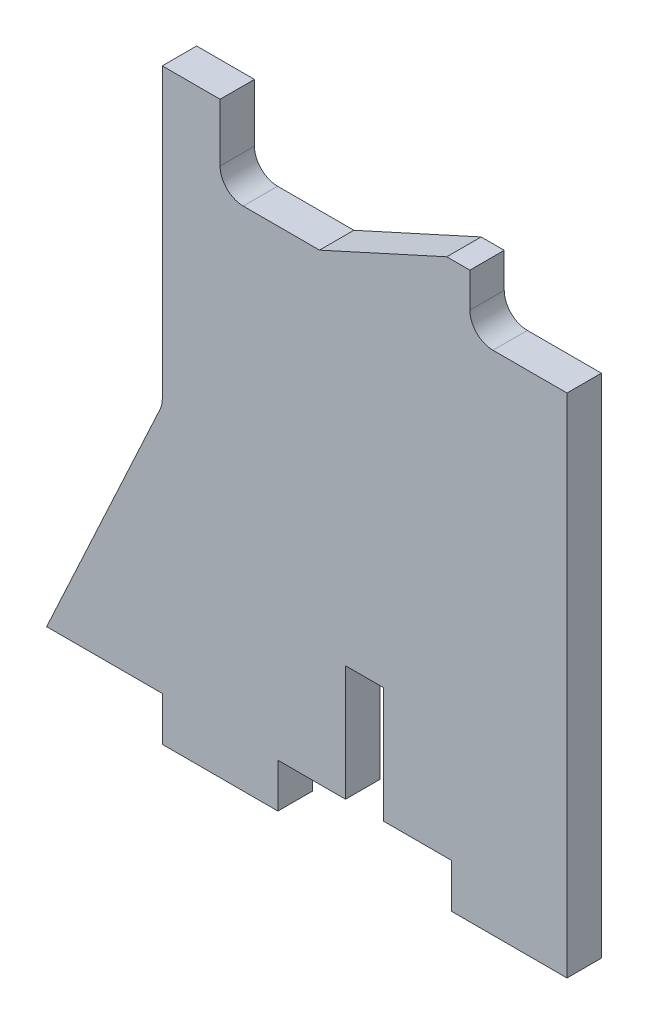
ISO-10303-21;
HEADER;
FILE_DESCRIPTION(('STEP AP214'),'2;1');
FILE_NAME('part.step','',(''),(''),'','','');
FILE_SCHEMA(('AUTOMOTIVE_DESIGN { 1 0 10303 214 1 1 1 1 }'));
ENDSEC;
DATA;
#1=APPLICATION_CONTEXT('core data for automotive mechanical design processes');
#2=APPLICATION_PROTOCOL_DEFINITION('international standard','automotive_design',2000,#1);
#3=PRODUCT_CONTEXT('',#1,'mechanical');
#4=PRODUCT('Part','Part','',(#3));
#5=PRODUCT_RELATED_PRODUCT_CATEGORY('part','',(#4));
#6=PRODUCT_DEFINITION_FORMATION('','',#4);
#7=PRODUCT_DEFINITION_CONTEXT('part definition',#1,'design');
#8=PRODUCT_DEFINITION('design','',#6,#7);
#9=PRODUCT_DEFINITION_SHAPE('','',#8);
#10=(LENGTH_UNIT() NAMED_UNIT(*) SI_UNIT(.MILLI.,.METRE.));
#11=(NAMED_UNIT(*) PLANE_ANGLE_UNIT() SI_UNIT($,.RADIAN.));
#12=(NAMED_UNIT(*) SI_UNIT($,.STERADIAN.) SOLID_ANGLE_UNIT());
#13=UNCERTAINTY_MEASURE_WITH_UNIT(LENGTH_MEASURE(1.E-05),#10,'distance_accuracy_value','');
#14=(GEOMETRIC_REPRESENTATION_CONTEXT(3) GLOBAL_UNCERTAINTY_ASSIGNED_CONTEXT((#13)) GLOBAL_UNIT_ASSIGNED_CONTEXT((#10,
#11,#12)) REPRESENTATION_CONTEXT('',''));
#15=CARTESIAN_POINT('',(0.,0.,0.));
#16=DIRECTION('',(0.,0.,1.));
#17=DIRECTION('',(1.,0.,0.));
#18=AXIS2_PLACEMENT_3D('',#15,#16,#17);
#19=CARTESIAN_POINT('',(-17.5,-20.,2.9718));
#20=DIRECTION('',(0.,1.,0.));
#21=DIRECTION('',(0.,0.,1.));
#22=AXIS2_PLACEMENT_3D('',#19,#20,#21);
#23=PLANE('',#22);
#24=DIRECTION('',(1.,0.,0.));
#25=VECTOR('',#24,1.);
#26=CARTESIAN_POINT('',(-17.5,-20.,0.));
#27=LINE('',#26,#25);
#28=CARTESIAN_POINT('',(-7.50000000000001,-20.,0.));
#29=VERTEX_POINT('',#28);
#30=CARTESIAN_POINT('',(-1.651,-20.,0.));
#31=VERTEX_POINT('',#30);
#32=EDGE_CURVE('E207',#29,#31,#27,.T.);
#33=ORIENTED_EDGE('',*,*,#32,.T.);
#34=DIRECTION('',(0.,0.,1.));
#35=VECTOR('',#34,1.);
#36=CARTESIAN_POINT('',(-1.651,-20.,0.));
#37=LINE('',#36,#35);
#38=CARTESIAN_POINT('',(-1.651,-20.,2.9718));
#39=VERTEX_POINT('',#38);
#40=EDGE_CURVE('E192',#31,#39,#37,.T.);
#41=ORIENTED_EDGE('',*,*,#40,.T.);
#42=DIRECTION('',(1.,0.,0.));
#43=VECTOR('',#42,1.);
#44=CARTESIAN_POINT('',(-17.5,-20.,2.9718));
#45=LINE('',#44,#43);
#46=CARTESIAN_POINT('',(-7.50000000000001,-20.,2.9718));
#47=VERTEX_POINT('',#46);
#48=EDGE_CURVE('E229',#47,#39,#45,.T.);
#49=ORIENTED_EDGE('',*,*,#48,.F.);
#50=DIRECTION('',(0.,0.,1.));
#51=VECTOR('',#50,1.);
#52=CARTESIAN_POINT('',(-7.50000000000001,-20.,0.));
#53=LINE('',#52,#51);
#54=EDGE_CURVE('E214',#29,#47,#53,.T.);
#55=ORIENTED_EDGE('',*,*,#54,.F.);
#56=EDGE_LOOP('',(#33,#41,#49,#55));
#57=FACE_BOUND('',#56,.T.);
#58=ADVANCED_FACE('F32',(#57),#23,.F.);
#59=CARTESIAN_POINT('',(-19.5,2.03559672661456,2.9718));
#60=DIRECTION('',(0.,0.,1.));
#61=DIRECTION('',(1.,0.,0.));
#62=AXIS2_PLACEMENT_3D('',#59,#60,#61);
#63=CYLINDRICAL_SURFACE('',#62,2.);
#64=DIRECTION('',(0.,0.,1.));
#65=VECTOR('',#64,1.);
#66=CARTESIAN_POINT('',(-17.5,2.03559672661456,2.9718));
#67=LINE('',#66,#65);
#68=CARTESIAN_POINT('',(-17.5,2.03559672661455,0.));
#69=VERTEX_POINT('',#68);
#70=CARTESIAN_POINT('',(-17.5,2.03559672661455,2.9718));
#71=VERTEX_POINT('',#70);
#72=EDGE_CURVE('E249',#69,#71,#67,.T.);
#73=ORIENTED_EDGE('',*,*,#72,.F.);
#74=CARTESIAN_POINT('',(-19.5,2.03559672661456,0.));
#75=DIRECTION('',(0.,0.,-1.));
#76=DIRECTION('',(-1.,0.,0.));
#77=AXIS2_PLACEMENT_3D('',#74,#75,#76);
#78=CIRCLE('',#77,2.);
#79=CARTESIAN_POINT('',(-17.68514036038,1.19518939175929,0.));
#80=VERTEX_POINT('',#79);
#81=EDGE_CURVE('E40',#69,#80,#78,.T.);
#82=ORIENTED_EDGE('',*,*,#81,.T.);
#83=DIRECTION('',(0.,0.,1.));
#84=VECTOR('',#83,1.);
#85=CARTESIAN_POINT('',(-17.68514036038,1.19518939175929,0.));
#86=LINE('',#85,#84);
#87=CARTESIAN_POINT('',(-17.68514036038,1.19518939175929,2.9718));
#88=VERTEX_POINT('',#87);
#89=EDGE_CURVE('E252',#88,#80,#86,.F.);
#90=ORIENTED_EDGE('',*,*,#89,.F.);
#91=CARTESIAN_POINT('',(-19.5,2.03559672661456,2.9718));
#92=DIRECTION('',(0.,0.,-1.));
#93=DIRECTION('',(-1.,0.,0.));
#94=AXIS2_PLACEMENT_3D('',#91,#92,#93);
#95=CIRCLE('',#94,2.);
#96=EDGE_CURVE('E11',#88,#71,#95,.F.);
#97=ORIENTED_EDGE('',*,*,#96,.T.);
#98=EDGE_LOOP('',(#73,#82,#90,#97));
#99=FACE_BOUND('',#98,.T.);
#100=ADVANCED_FACE('F34',(#99),#63,.F.);
#101=CARTESIAN_POINT('',(11.0995698808157,22.,0.));
#102=DIRECTION('',(0.,0.,-1.));
#103=DIRECTION('',(-1.,0.,0.));
#104=AXIS2_PLACEMENT_3D('',#101,#102,#103);
#105=CYLINDRICAL_SURFACE('',#104,2.);
#106=DIRECTION('',(0.,0.,-1.));
#107=VECTOR('',#106,1.);
#108=CARTESIAN_POINT('',(9.09956988081569,22.,0.));
#109=LINE('',#108,#107);
#110=CARTESIAN_POINT('',(9.09956988081569,22.,2.9718));
#111=VERTEX_POINT('',#110);
#112=CARTESIAN_POINT('',(9.09956988081569,22.,0.));
#113=VERTEX_POINT('',#112);
#114=EDGE_CURVE('E239',#111,#113,#109,.T.);
#115=ORIENTED_EDGE('',*,*,#114,.F.);
#116=CARTESIAN_POINT('',(11.0995698808157,22.,2.9718));
#117=DIRECTION('',(0.,0.,-1.));
#118=DIRECTION('',(-1.,0.,0.));
#119=AXIS2_PLACEMENT_3D('',#116,#117,#118);
#120=CIRCLE('',#119,2.);
#121=CARTESIAN_POINT('',(11.0995698808157,20.,2.9718));
#122=VERTEX_POINT('',#121);
#123=EDGE_CURVE('E245',#111,#122,#120,.F.);
#124=ORIENTED_EDGE('',*,*,#123,.T.);
#125=DIRECTION('',(0.,0.,-1.));
#126=VECTOR('',#125,1.);
#127=CARTESIAN_POINT('',(11.0995698808157,20.,2.9718));
#128=LINE('',#127,#126);
#129=CARTESIAN_POINT('',(11.0995698808157,20.,0.));
#130=VERTEX_POINT('',#129);
#131=EDGE_CURVE('E242',#130,#122,#128,.F.);
#132=ORIENTED_EDGE('',*,*,#131,.F.);
#133=CARTESIAN_POINT('',(11.0995698808157,22.,0.));
#134=DIRECTION('',(0.,0.,-1.));
#135=DIRECTION('',(-1.,0.,0.));
#136=AXIS2_PLACEMENT_3D('',#133,#134,#135);
#137=CIRCLE('',#136,2.);
#138=EDGE_CURVE('E247',#130,#113,#137,.T.);
#139=ORIENTED_EDGE('',*,*,#138,.T.);
#140=EDGE_LOOP('',(#115,#124,#132,#139));
#141=FACE_BOUND('',#140,.T.);
#142=ADVANCED_FACE('F400',(#141),#105,.F.);
#143=CARTESIAN_POINT('',(-10.5,22.,0.));
#144=DIRECTION('',(0.,0.,-1.));
#145=DIRECTION('',(-1.,0.,0.));
#146=AXIS2_PLACEMENT_3D('',#143,#144,#145);
#147=CYLINDRICAL_SURFACE('',#146,2.);
#148=DIRECTION('',(0.,0.,-1.));
#149=VECTOR('',#148,1.);
#150=CARTESIAN_POINT('',(-12.5,22.,0.));
#151=LINE('',#150,#149);
#152=CARTESIAN_POINT('',(-12.5,22.,2.9718));
#153=VERTEX_POINT('',#152);
#154=CARTESIAN_POINT('',(-12.5,22.,0.));
#155=VERTEX_POINT('',#154);
#156=EDGE_CURVE('E228',#153,#155,#151,.T.);
#157=ORIENTED_EDGE('',*,*,#156,.F.);
#158=CARTESIAN_POINT('',(-10.5,22.,2.9718));
#159=DIRECTION('',(0.,0.,-1.));
#160=DIRECTION('',(-1.,0.,0.));
#161=AXIS2_PLACEMENT_3D('',#158,#159,#160);
#162=CIRCLE('',#161,2.);
#163=CARTESIAN_POINT('',(-10.5,20.,2.9718));
#164=VERTEX_POINT('',#163);
#165=EDGE_CURVE('E235',#153,#164,#162,.F.);
#166=ORIENTED_EDGE('',*,*,#165,.T.);
#167=DIRECTION('',(0.,0.,-1.));
#168=VECTOR('',#167,1.);
#169=CARTESIAN_POINT('',(-10.5,20.,2.9718));
#170=LINE('',#169,#168);
#171=CARTESIAN_POINT('',(-10.5,20.,0.));
#172=VERTEX_POINT('',#171);
#173=EDGE_CURVE('E232',#172,#164,#170,.F.);
#174=ORIENTED_EDGE('',*,*,#173,.F.);
#175=CARTESIAN_POINT('',(-10.5,22.,0.));
#176=DIRECTION('',(0.,0.,-1.));
#177=DIRECTION('',(-1.,0.,0.));
#178=AXIS2_PLACEMENT_3D('',#175,#176,#177);
#179=CIRCLE('',#178,2.);
#180=EDGE_CURVE('E237',#172,#155,#179,.T.);
#181=ORIENTED_EDGE('',*,*,#180,.T.);
#182=EDGE_LOOP('',(#157,#166,#174,#181));
#183=FACE_BOUND('',#182,.T.);
#184=ADVANCED_FACE('F382',(#183),#147,.F.);
#185=CARTESIAN_POINT('',(-17.5,-20.,2.9718));
#186=DIRECTION('',(1.,0.,0.));
#187=DIRECTION('',(0.,0.,-1.));
#188=AXIS2_PLACEMENT_3D('',#185,#186,#187);
#189=PLANE('',#188);
#190=DIRECTION('',(0.,0.,1.));
#191=VECTOR('',#190,1.);
#192=CARTESIAN_POINT('',(-17.5,-20.,0.));
#193=LINE('',#192,#191);
#194=CARTESIAN_POINT('',(-17.5,-20.,0.));
#195=VERTEX_POINT('',#194);
#196=CARTESIAN_POINT('',(-17.5,-20.,2.9718));
#197=VERTEX_POINT('',#196);
#198=EDGE_CURVE('E274',#195,#197,#193,.T.);
#199=ORIENTED_EDGE('',*,*,#198,.F.);
#200=DIRECTION('',(0.,-1.,0.));
#201=VECTOR('',#200,1.);
#202=CARTESIAN_POINT('',(-17.5,-20.,0.));
#203=LINE('',#202,#201);
#204=CARTESIAN_POINT('',(-17.5,-23.81,0.));
#205=VERTEX_POINT('',#204);
#206=EDGE_CURVE('E368',#195,#205,#203,.T.);
#207=ORIENTED_EDGE('',*,*,#206,.T.);
#208=DIRECTION('',(0.,0.,1.));
#209=VECTOR('',#208,1.);
#210=CARTESIAN_POINT('',(-17.5,-23.81,0.));
#211=LINE('',#210,#209);
#212=CARTESIAN_POINT('',(-17.5,-23.81,2.9718));
#213=VERTEX_POINT('',#212);
#214=EDGE_CURVE('E304',#205,#213,#211,.T.);
#215=ORIENTED_EDGE('',*,*,#214,.T.);
#216=DIRECTION('',(0.,-1.,0.));
#217=VECTOR('',#216,1.);
#218=CARTESIAN_POINT('',(-17.5,-20.,2.9718));
#219=LINE('',#218,#217);
#220=EDGE_CURVE('E358',#197,#213,#219,.T.);
#221=ORIENTED_EDGE('',*,*,#220,.F.);
#222=EDGE_LOOP('',(#199,#207,#215,#221));
#223=FACE_BOUND('',#222,.T.);
#224=ADVANCED_FACE('F452',(#223),#189,.F.);
#225=CARTESIAN_POINT('',(1.65100000000001,-20.,2.9718));
#226=VERTEX_POINT('',#225);
#227=CARTESIAN_POINT('',(7.5,-20.,2.9718));
#228=VERTEX_POINT('',#227);
#229=EDGE_CURVE('E362',#226,#228,#45,.T.);
#230=ORIENTED_EDGE('',*,*,#229,.F.);
#231=DIRECTION('',(0.,0.,1.));
#232=VECTOR('',#231,1.);
#233=CARTESIAN_POINT('',(1.65100000000001,-20.,0.));
#234=LINE('',#233,#232);
#235=CARTESIAN_POINT('',(1.65100000000001,-20.,0.));
#236=VERTEX_POINT('',#235);
#237=EDGE_CURVE('E201',#236,#226,#234,.T.);
#238=ORIENTED_EDGE('',*,*,#237,.F.);
#239=CARTESIAN_POINT('',(7.5,-20.,0.));
#240=VERTEX_POINT('',#239);
#241=EDGE_CURVE('E216',#236,#240,#27,.T.);
#242=ORIENTED_EDGE('',*,*,#241,.T.);
#243=DIRECTION('',(0.,0.,1.));
#244=VECTOR('',#243,1.);
#245=CARTESIAN_POINT('',(7.5,-20.,0.));
#246=LINE('',#245,#244);
#247=EDGE_CURVE('E285',#240,#228,#246,.T.);
#248=ORIENTED_EDGE('',*,*,#247,.T.);
#249=EDGE_LOOP('',(#230,#238,#242,#248));
#250=FACE_BOUND('',#249,.T.);
#251=ADVANCED_FACE('F418',(#250),#23,.F.);
#252=CARTESIAN_POINT('',(-17.5,20.,2.9718));
#253=DIRECTION('',(0.,-1.,0.));
#254=DIRECTION('',(0.,0.,-1.));
#255=AXIS2_PLACEMENT_3D('',#252,#253,#254);
#256=PLANE('',#255);
#257=DIRECTION('',(-1.,0.,0.));
#258=VECTOR('',#257,1.);
#259=CARTESIAN_POINT('',(-17.5,20.,0.));
#260=LINE('',#259,#258);
#261=CARTESIAN_POINT('',(-3.90043011918431,20.,0.));
#262=VERTEX_POINT('',#261);
#263=EDGE_CURVE('E365',#262,#172,#260,.T.);
#264=ORIENTED_EDGE('',*,*,#263,.T.);
#265=ORIENTED_EDGE('',*,*,#173,.T.);
#266=DIRECTION('',(-1.,0.,0.));
#267=VECTOR('',#266,1.);
#268=CARTESIAN_POINT('',(-17.5,20.,2.9718));
#269=LINE('',#268,#267);
#270=CARTESIAN_POINT('',(-3.90043011918433,20.,2.9718));
#271=VERTEX_POINT('',#270);
#272=EDGE_CURVE('E219',#271,#164,#269,.T.);
#273=ORIENTED_EDGE('',*,*,#272,.F.);
#274=DIRECTION('',(0.,0.,1.));
#275=VECTOR('',#274,1.);
#276=CARTESIAN_POINT('',(-3.90043011918431,20.,0.));
#277=LINE('',#276,#275);
#278=EDGE_CURVE('E331',#262,#271,#277,.T.);
#279=ORIENTED_EDGE('',*,*,#278,.F.);
#280=EDGE_LOOP('',(#264,#265,#273,#279));
#281=FACE_BOUND('',#280,.T.);
#282=ADVANCED_FACE('F373',(#281),#256,.F.);
#283=CARTESIAN_POINT('',(17.5,-20.,2.9718));
#284=DIRECTION('',(-1.,0.,0.));
#285=DIRECTION('',(0.,0.,1.));
#286=AXIS2_PLACEMENT_3D('',#283,#284,#285);
#287=PLANE('',#286);
#288=DIRECTION('',(0.,1.,0.));
#289=VECTOR('',#288,1.);
#290=CARTESIAN_POINT('',(17.5,-20.,0.));
#291=LINE('',#290,#289);
#292=CARTESIAN_POINT('',(17.5,-23.81,0.));
#293=VERTEX_POINT('',#292);
#294=CARTESIAN_POINT('',(17.5,20.,0.));
#295=VERTEX_POINT('',#294);
#296=EDGE_CURVE('E352',#293,#295,#291,.T.);
#297=ORIENTED_EDGE('',*,*,#296,.T.);
#298=DIRECTION('',(0.,0.,-1.));
#299=VECTOR('',#298,1.);
#300=CARTESIAN_POINT('',(17.5,20.,2.9718));
#301=LINE('',#300,#299);
#302=CARTESIAN_POINT('',(17.5,20.,2.9718));
#303=VERTEX_POINT('',#302);
#304=EDGE_CURVE('E225',#303,#295,#301,.T.);
#305=ORIENTED_EDGE('',*,*,#304,.F.);
#306=DIRECTION('',(0.,1.,0.));
#307=VECTOR('',#306,1.);
#308=CARTESIAN_POINT('',(17.5,-20.,2.9718));
#309=LINE('',#308,#307);
#310=CARTESIAN_POINT('',(17.5,-23.81,2.9718));
#311=VERTEX_POINT('',#310);
#312=EDGE_CURVE('E215',#311,#303,#309,.T.);
#313=ORIENTED_EDGE('',*,*,#312,.F.);
#314=DIRECTION('',(0.,0.,1.));
#315=VECTOR('',#314,1.);
#316=CARTESIAN_POINT('',(17.5,-23.81,0.));
#317=LINE('',#316,#315);
#318=EDGE_CURVE('E290',#293,#311,#317,.T.);
#319=ORIENTED_EDGE('',*,*,#318,.F.);
#320=EDGE_LOOP('',(#297,#305,#313,#319));
#321=FACE_BOUND('',#320,.T.);
#322=ADVANCED_FACE('F406',(#321),#287,.F.);
#323=EDGE_CURVE('E366',#295,#130,#260,.T.);
#324=ORIENTED_EDGE('',*,*,#323,.T.);
#325=ORIENTED_EDGE('',*,*,#131,.T.);
#326=EDGE_CURVE('E355',#303,#122,#269,.T.);
#327=ORIENTED_EDGE('',*,*,#326,.F.);
#328=ORIENTED_EDGE('',*,*,#304,.T.);
#329=EDGE_LOOP('',(#324,#325,#327,#328));
#330=FACE_BOUND('',#329,.T.);
#331=ADVANCED_FACE('F401',(#330),#256,.F.);
#332=CARTESIAN_POINT('',(-17.5,27.,0.));
#333=VERTEX_POINT('',#332);
#334=EDGE_CURVE('E221',#333,#69,#203,.T.);
#335=ORIENTED_EDGE('',*,*,#334,.T.);
#336=ORIENTED_EDGE('',*,*,#72,.T.);
#337=CARTESIAN_POINT('',(-17.5,27.,2.9718));
#338=VERTEX_POINT('',#337);
#339=EDGE_CURVE('E359',#338,#71,#219,.T.);
#340=ORIENTED_EDGE('',*,*,#339,.F.);
#341=DIRECTION('',(0.,0.,1.));
#342=VECTOR('',#341,1.);
#343=CARTESIAN_POINT('',(-17.5,27.,0.));
#344=LINE('',#343,#342);
#345=EDGE_CURVE('E349',#333,#338,#344,.T.);
#346=ORIENTED_EDGE('',*,*,#345,.F.);
#347=EDGE_LOOP('',(#335,#336,#340,#346));
#348=FACE_BOUND('',#347,.T.);
#349=ADVANCED_FACE('F459',(#348),#189,.F.);
#350=CARTESIAN_POINT('',(0.,0.,2.9718));
#351=DIRECTION('',(0.,0.,-1.));
#352=DIRECTION('',(-1.,0.,0.));
#353=AXIS2_PLACEMENT_3D('',#350,#351,#352);
#354=PLANE('',#353);
#355=ORIENTED_EDGE('',*,*,#48,.T.);
#356=DIRECTION('',(0.,-1.,0.));
#357=VECTOR('',#356,1.);
#358=CARTESIAN_POINT('',(-1.651,-20.,2.9718));
#359=LINE('',#358,#357);
#360=CARTESIAN_POINT('',(-1.651,-10.,2.9718));
#361=VERTEX_POINT('',#360);
#362=EDGE_CURVE('E197',#361,#39,#359,.T.);
#363=ORIENTED_EDGE('',*,*,#362,.F.);
#364=DIRECTION('',(-1.,0.,0.));
#365=VECTOR('',#364,1.);
#366=CARTESIAN_POINT('',(-1.651,-10.,2.9718));
#367=LINE('',#366,#365);
#368=CARTESIAN_POINT('',(1.651,-10.,2.9718));
#369=VERTEX_POINT('',#368);
#370=EDGE_CURVE('E211',#369,#361,#367,.T.);
#371=ORIENTED_EDGE('',*,*,#370,.F.);
#372=DIRECTION('',(0.,1.,0.));
#373=VECTOR('',#372,1.);
#374=CARTESIAN_POINT('',(1.65100000000001,-20.,2.9718));
#375=LINE('',#374,#373);
#376=EDGE_CURVE('E425',#226,#369,#375,.T.);
#377=ORIENTED_EDGE('',*,*,#376,.F.);
#378=ORIENTED_EDGE('',*,*,#229,.T.);
#379=DIRECTION('',(0.,-1.,0.));
#380=VECTOR('',#379,1.);
#381=CARTESIAN_POINT('',(7.5,-20.,2.9718));
#382=LINE('',#381,#380);
#383=CARTESIAN_POINT('',(7.5,-23.81,2.9718));
#384=VERTEX_POINT('',#383);
#385=EDGE_CURVE('E276',#228,#384,#382,.T.);
#386=ORIENTED_EDGE('',*,*,#385,.T.);
#387=DIRECTION('',(1.,0.,0.));
#388=VECTOR('',#387,1.);
#389=CARTESIAN_POINT('',(17.5,-23.81,2.9718));
#390=LINE('',#389,#388);
#391=EDGE_CURVE('E282',#384,#311,#390,.T.);
#392=ORIENTED_EDGE('',*,*,#391,.T.);
#393=ORIENTED_EDGE('',*,*,#312,.T.);
#394=ORIENTED_EDGE('',*,*,#326,.T.);
#395=ORIENTED_EDGE('',*,*,#123,.F.);
#396=DIRECTION('',(0.,1.,0.));
#397=VECTOR('',#396,1.);
#398=CARTESIAN_POINT('',(9.09956988081569,25.,2.9718));
#399=LINE('',#398,#397);
#400=CARTESIAN_POINT('',(9.09956988081569,25.,2.9718));
#401=VERTEX_POINT('',#400);
#402=EDGE_CURVE('E310',#111,#401,#399,.T.);
#403=ORIENTED_EDGE('',*,*,#402,.T.);
#404=DIRECTION('',(-1.,0.,0.));
#405=VECTOR('',#404,1.);
#406=CARTESIAN_POINT('',(7.09956988081569,25.,2.9718));
#407=LINE('',#406,#405);
#408=CARTESIAN_POINT('',(7.09956988081569,25.,2.9718));
#409=VERTEX_POINT('',#408);
#410=EDGE_CURVE('E326',#401,#409,#407,.T.);
#411=ORIENTED_EDGE('',*,*,#410,.T.);
#412=DIRECTION('',(-0.910366477462605,-0.413802944301184,0.));
#413=VECTOR('',#412,1.);
#414=CARTESIAN_POINT('',(-3.90043011918431,20.,2.9718));
#415=LINE('',#414,#413);
#416=EDGE_CURVE('E318',#409,#271,#415,.T.);
#417=ORIENTED_EDGE('',*,*,#416,.T.);
#418=ORIENTED_EDGE('',*,*,#272,.T.);
#419=ORIENTED_EDGE('',*,*,#165,.F.);
#420=DIRECTION('',(0.,1.,0.));
#421=VECTOR('',#420,1.);
#422=CARTESIAN_POINT('',(-12.5,20.,2.9718));
#423=LINE('',#422,#421);
#424=CARTESIAN_POINT('',(-12.5,27.,2.9718));
#425=VERTEX_POINT('',#424);
#426=EDGE_CURVE('E334',#153,#425,#423,.T.);
#427=ORIENTED_EDGE('',*,*,#426,.T.);
#428=DIRECTION('',(-1.,0.,0.));
#429=VECTOR('',#428,1.);
#430=CARTESIAN_POINT('',(-17.5,27.,2.9718));
#431=LINE('',#430,#429);
#432=EDGE_CURVE('E342',#425,#338,#431,.T.);
#433=ORIENTED_EDGE('',*,*,#432,.T.);
#434=ORIENTED_EDGE('',*,*,#339,.T.);
#435=ORIENTED_EDGE('',*,*,#96,.F.);
#436=DIRECTION('',(-0.420203667427634,-0.907429819809977,0.));
#437=VECTOR('',#436,1.);
#438=CARTESIAN_POINT('',(-27.5,-20.,2.9718));
#439=LINE('',#438,#437);
#440=CARTESIAN_POINT('',(-27.5,-20.,2.9718));
#441=VERTEX_POINT('',#440);
#442=EDGE_CURVE('E260',#88,#441,#439,.T.);
#443=ORIENTED_EDGE('',*,*,#442,.T.);
#444=DIRECTION('',(1.,0.,0.));
#445=VECTOR('',#444,1.);
#446=CARTESIAN_POINT('',(-17.5,-20.,2.9718));
#447=LINE('',#446,#445);
#448=EDGE_CURVE('E264',#441,#197,#447,.T.);
#449=ORIENTED_EDGE('',*,*,#448,.T.);
#450=ORIENTED_EDGE('',*,*,#220,.T.);
#451=DIRECTION('',(1.,0.,0.));
#452=VECTOR('',#451,1.);
#453=CARTESIAN_POINT('',(-17.5,-23.81,2.9718));
#454=LINE('',#453,#452);
#455=CARTESIAN_POINT('',(-7.50000000000001,-23.81,2.9718));
#456=VERTEX_POINT('',#455);
#457=EDGE_CURVE('E293',#213,#456,#454,.T.);
#458=ORIENTED_EDGE('',*,*,#457,.T.);
#459=DIRECTION('',(0.,1.,0.));
#460=VECTOR('',#459,1.);
#461=CARTESIAN_POINT('',(-7.50000000000001,-20.,2.9718));
#462=LINE('',#461,#460);
#463=EDGE_CURVE('E302',#456,#47,#462,.T.);
#464=ORIENTED_EDGE('',*,*,#463,.T.);
#465=EDGE_LOOP('',(#355,#363,#371,#377,#378,#386,#392,#393,#394,#395,#403,#411,#417,#418,#419,
#427,#433,#434,#435,#443,#449,#450,#458,#464));
#466=FACE_BOUND('',#465,.T.);
#467=ADVANCED_FACE('F385',(#466),#354,.F.);
#468=CARTESIAN_POINT('',(0.,0.,0.));
#469=DIRECTION('',(0.,0.,-1.));
#470=DIRECTION('',(-1.,0.,0.));
#471=AXIS2_PLACEMENT_3D('',#468,#469,#470);
#472=PLANE('',#471);
#473=DIRECTION('',(0.,-1.,0.));
#474=VECTOR('',#473,1.);
#475=CARTESIAN_POINT('',(-1.651,-20.,0.));
#476=LINE('',#475,#474);
#477=CARTESIAN_POINT('',(-1.651,-10.,0.));
#478=VERTEX_POINT('',#477);
#479=EDGE_CURVE('E195',#478,#31,#476,.T.);
#480=ORIENTED_EDGE('',*,*,#479,.T.);
#481=ORIENTED_EDGE('',*,*,#32,.F.);
#482=DIRECTION('',(0.,1.,0.));
#483=VECTOR('',#482,1.);
#484=CARTESIAN_POINT('',(-7.50000000000001,-20.,0.));
#485=LINE('',#484,#483);
#486=CARTESIAN_POINT('',(-7.50000000000001,-23.81,0.));
#487=VERTEX_POINT('',#486);
#488=EDGE_CURVE('E301',#487,#29,#485,.T.);
#489=ORIENTED_EDGE('',*,*,#488,.F.);
#490=DIRECTION('',(1.,0.,0.));
#491=VECTOR('',#490,1.);
#492=CARTESIAN_POINT('',(-17.5,-23.81,0.));
#493=LINE('',#492,#491);
#494=EDGE_CURVE('E298',#205,#487,#493,.T.);
#495=ORIENTED_EDGE('',*,*,#494,.F.);
#496=ORIENTED_EDGE('',*,*,#206,.F.);
#497=DIRECTION('',(1.,0.,0.));
#498=VECTOR('',#497,1.);
#499=CARTESIAN_POINT('',(-17.5,-20.,0.));
#500=LINE('',#499,#498);
#501=CARTESIAN_POINT('',(-27.5,-20.,0.));
#502=VERTEX_POINT('',#501);
#503=EDGE_CURVE('E263',#502,#195,#500,.T.);
#504=ORIENTED_EDGE('',*,*,#503,.F.);
#505=DIRECTION('',(-0.420203667427634,-0.907429819809977,0.));
#506=VECTOR('',#505,1.);
#507=CARTESIAN_POINT('',(-27.5,-20.,0.));
#508=LINE('',#507,#506);
#509=EDGE_CURVE('E258',#80,#502,#508,.T.);
#510=ORIENTED_EDGE('',*,*,#509,.F.);
#511=ORIENTED_EDGE('',*,*,#81,.F.);
#512=ORIENTED_EDGE('',*,*,#334,.F.);
#513=DIRECTION('',(-1.,0.,0.));
#514=VECTOR('',#513,1.);
#515=CARTESIAN_POINT('',(-17.5,27.,0.));
#516=LINE('',#515,#514);
#517=CARTESIAN_POINT('',(-12.5,27.,0.));
#518=VERTEX_POINT('',#517);
#519=EDGE_CURVE('E341',#518,#333,#516,.T.);
#520=ORIENTED_EDGE('',*,*,#519,.F.);
#521=DIRECTION('',(0.,1.,0.));
#522=VECTOR('',#521,1.);
#523=CARTESIAN_POINT('',(-12.5,20.,0.));
#524=LINE('',#523,#522);
#525=EDGE_CURVE('E339',#155,#518,#524,.T.);
#526=ORIENTED_EDGE('',*,*,#525,.F.);
#527=ORIENTED_EDGE('',*,*,#180,.F.);
#528=ORIENTED_EDGE('',*,*,#263,.F.);
#529=DIRECTION('',(-0.910366477462605,-0.413802944301184,0.));
#530=VECTOR('',#529,1.);
#531=CARTESIAN_POINT('',(-3.90043011918431,20.,0.));
#532=LINE('',#531,#530);
#533=CARTESIAN_POINT('',(7.09956988081569,25.,0.));
#534=VERTEX_POINT('',#533);
#535=EDGE_CURVE('E321',#534,#262,#532,.T.);
#536=ORIENTED_EDGE('',*,*,#535,.F.);
#537=DIRECTION('',(-1.,0.,0.));
#538=VECTOR('',#537,1.);
#539=CARTESIAN_POINT('',(7.09956988081569,25.,0.));
#540=LINE('',#539,#538);
#541=CARTESIAN_POINT('',(9.09956988081569,25.,0.));
#542=VERTEX_POINT('',#541);
#543=EDGE_CURVE('E317',#542,#534,#540,.T.);
#544=ORIENTED_EDGE('',*,*,#543,.F.);
#545=DIRECTION('',(0.,1.,0.));
#546=VECTOR('',#545,1.);
#547=CARTESIAN_POINT('',(9.09956988081569,25.,0.));
#548=LINE('',#547,#546);
#549=EDGE_CURVE('E315',#113,#542,#548,.T.);
#550=ORIENTED_EDGE('',*,*,#549,.F.);
#551=ORIENTED_EDGE('',*,*,#138,.F.);
#552=ORIENTED_EDGE('',*,*,#323,.F.);
#553=ORIENTED_EDGE('',*,*,#296,.F.);
#554=DIRECTION('',(1.,0.,0.));
#555=VECTOR('',#554,1.);
#556=CARTESIAN_POINT('',(17.5,-23.81,0.));
#557=LINE('',#556,#555);
#558=CARTESIAN_POINT('',(7.5,-23.81,0.));
#559=VERTEX_POINT('',#558);
#560=EDGE_CURVE('E281',#559,#293,#557,.T.);
#561=ORIENTED_EDGE('',*,*,#560,.F.);
#562=DIRECTION('',(0.,-1.,0.));
#563=VECTOR('',#562,1.);
#564=CARTESIAN_POINT('',(7.5,-20.,0.));
#565=LINE('',#564,#563);
#566=EDGE_CURVE('E278',#240,#559,#565,.T.);
#567=ORIENTED_EDGE('',*,*,#566,.F.);
#568=ORIENTED_EDGE('',*,*,#241,.F.);
#569=DIRECTION('',(0.,1.,0.));
#570=VECTOR('',#569,1.);
#571=CARTESIAN_POINT('',(1.65100000000001,-20.,0.));
#572=LINE('',#571,#570);
#573=CARTESIAN_POINT('',(1.651,-10.,0.));
#574=VERTEX_POINT('',#573);
#575=EDGE_CURVE('E210',#236,#574,#572,.T.);
#576=ORIENTED_EDGE('',*,*,#575,.T.);
#577=DIRECTION('',(-1.,0.,0.));
#578=VECTOR('',#577,1.);
#579=CARTESIAN_POINT('',(-1.651,-10.,0.));
#580=LINE('',#579,#578);
#581=EDGE_CURVE('E47',#574,#478,#580,.T.);
#582=ORIENTED_EDGE('',*,*,#581,.T.);
#583=EDGE_LOOP('',(#480,#481,#489,#495,#496,#504,#510,#511,#512,#520,#526,#527,#528,#536,#544,
#550,#551,#552,#553,#561,#567,#568,#576,#582));
#584=FACE_BOUND('',#583,.T.);
#585=ADVANCED_FACE('F205',(#584),#472,.T.);
#586=CARTESIAN_POINT('',(-17.5,27.,0.));
#587=DIRECTION('',(0.,1.,0.));
#588=DIRECTION('',(0.,0.,1.));
#589=AXIS2_PLACEMENT_3D('',#586,#587,#588);
#590=PLANE('',#589);
#591=ORIENTED_EDGE('',*,*,#432,.F.);
#592=DIRECTION('',(0.,0.,1.));
#593=VECTOR('',#592,1.);
#594=CARTESIAN_POINT('',(-12.5,27.,0.));
#595=LINE('',#594,#593);
#596=EDGE_CURVE('E345',#518,#425,#595,.T.);
#597=ORIENTED_EDGE('',*,*,#596,.F.);
#598=ORIENTED_EDGE('',*,*,#519,.T.);
#599=ORIENTED_EDGE('',*,*,#345,.T.);
#600=EDGE_LOOP('',(#591,#597,#598,#599));
#601=FACE_BOUND('',#600,.T.);
#602=ADVANCED_FACE('F477',(#601),#590,.T.);
#603=CARTESIAN_POINT('',(-12.5,20.,0.));
#604=DIRECTION('',(1.,0.,0.));
#605=DIRECTION('',(0.,0.,-1.));
#606=AXIS2_PLACEMENT_3D('',#603,#604,#605);
#607=PLANE('',#606);
#608=ORIENTED_EDGE('',*,*,#426,.F.);
#609=ORIENTED_EDGE('',*,*,#156,.T.);
#610=ORIENTED_EDGE('',*,*,#525,.T.);
#611=ORIENTED_EDGE('',*,*,#596,.T.);
#612=EDGE_LOOP('',(#608,#609,#610,#611));
#613=FACE_BOUND('',#612,.T.);
#614=ADVANCED_FACE('F479',(#613),#607,.T.);
#615=CARTESIAN_POINT('',(-3.90043011918431,20.,0.));
#616=DIRECTION('',(-0.413802944301184,0.910366477462605,0.));
#617=DIRECTION('',(-0.910366477462605,-0.413802944301184,0.));
#618=AXIS2_PLACEMENT_3D('',#615,#616,#617);
#619=PLANE('',#618);
#620=ORIENTED_EDGE('',*,*,#416,.F.);
#621=DIRECTION('',(0.,0.,1.));
#622=VECTOR('',#621,1.);
#623=CARTESIAN_POINT('',(7.09956988081569,25.,0.));
#624=LINE('',#623,#622);
#625=EDGE_CURVE('E335',#534,#409,#624,.T.);
#626=ORIENTED_EDGE('',*,*,#625,.F.);
#627=ORIENTED_EDGE('',*,*,#535,.T.);
#628=ORIENTED_EDGE('',*,*,#278,.T.);
#629=EDGE_LOOP('',(#620,#626,#627,#628));
#630=FACE_BOUND('',#629,.T.);
#631=ADVANCED_FACE('F388',(#630),#619,.T.);
#632=CARTESIAN_POINT('',(7.09956988081569,25.,0.));
#633=DIRECTION('',(0.,1.,0.));
#634=DIRECTION('',(0.,0.,1.));
#635=AXIS2_PLACEMENT_3D('',#632,#633,#634);
#636=PLANE('',#635);
#637=ORIENTED_EDGE('',*,*,#410,.F.);
#638=DIRECTION('',(0.,0.,1.));
#639=VECTOR('',#638,1.);
#640=CARTESIAN_POINT('',(9.09956988081569,25.,0.));
#641=LINE('',#640,#639);
#642=EDGE_CURVE('E324',#542,#401,#641,.T.);
#643=ORIENTED_EDGE('',*,*,#642,.F.);
#644=ORIENTED_EDGE('',*,*,#543,.T.);
#645=ORIENTED_EDGE('',*,*,#625,.T.);
#646=EDGE_LOOP('',(#637,#643,#644,#645));
#647=FACE_BOUND('',#646,.T.);
#648=ADVANCED_FACE('F392',(#647),#636,.T.);
#649=CARTESIAN_POINT('',(9.09956988081569,25.,0.));
#650=DIRECTION('',(1.,0.,0.));
#651=DIRECTION('',(0.,0.,-1.));
#652=AXIS2_PLACEMENT_3D('',#649,#650,#651);
#653=PLANE('',#652);
#654=ORIENTED_EDGE('',*,*,#402,.F.);
#655=ORIENTED_EDGE('',*,*,#114,.T.);
#656=ORIENTED_EDGE('',*,*,#549,.T.);
#657=ORIENTED_EDGE('',*,*,#642,.T.);
#658=EDGE_LOOP('',(#654,#655,#656,#657));
#659=FACE_BOUND('',#658,.T.);
#660=ADVANCED_FACE('F397',(#659),#653,.T.);
#661=CARTESIAN_POINT('',(-7.50000000000001,-20.,0.));
#662=DIRECTION('',(1.,0.,0.));
#663=DIRECTION('',(0.,0.,-1.));
#664=AXIS2_PLACEMENT_3D('',#661,#662,#663);
#665=PLANE('',#664);
#666=ORIENTED_EDGE('',*,*,#463,.F.);
#667=DIRECTION('',(0.,0.,1.));
#668=VECTOR('',#667,1.);
#669=CARTESIAN_POINT('',(-7.50000000000001,-23.81,0.));
#670=LINE('',#669,#668);
#671=EDGE_CURVE('E311',#487,#456,#670,.T.);
#672=ORIENTED_EDGE('',*,*,#671,.F.);
#673=ORIENTED_EDGE('',*,*,#488,.T.);
#674=ORIENTED_EDGE('',*,*,#54,.T.);
#675=EDGE_LOOP('',(#666,#672,#673,#674));
#676=FACE_BOUND('',#675,.T.);
#677=ADVANCED_FACE('F526',(#676),#665,.T.);
#678=CARTESIAN_POINT('',(-17.5,-23.81,0.));
#679=DIRECTION('',(0.,-1.,0.));
#680=DIRECTION('',(0.,0.,-1.));
#681=AXIS2_PLACEMENT_3D('',#678,#679,#680);
#682=PLANE('',#681);
#683=ORIENTED_EDGE('',*,*,#457,.F.);
#684=ORIENTED_EDGE('',*,*,#214,.F.);
#685=ORIENTED_EDGE('',*,*,#494,.T.);
#686=ORIENTED_EDGE('',*,*,#671,.T.);
#687=EDGE_LOOP('',(#683,#684,#685,#686));
#688=FACE_BOUND('',#687,.T.);
#689=ADVANCED_FACE('F531',(#688),#682,.T.);
#690=CARTESIAN_POINT('',(17.5,-23.81,0.));
#691=DIRECTION('',(0.,-1.,0.));
#692=DIRECTION('',(0.,0.,-1.));
#693=AXIS2_PLACEMENT_3D('',#690,#691,#692);
#694=PLANE('',#693);
#695=ORIENTED_EDGE('',*,*,#391,.F.);
#696=DIRECTION('',(0.,0.,1.));
#697=VECTOR('',#696,1.);
#698=CARTESIAN_POINT('',(7.5,-23.81,0.));
#699=LINE('',#698,#697);
#700=EDGE_CURVE('E294',#559,#384,#699,.T.);
#701=ORIENTED_EDGE('',*,*,#700,.F.);
#702=ORIENTED_EDGE('',*,*,#560,.T.);
#703=ORIENTED_EDGE('',*,*,#318,.T.);
#704=EDGE_LOOP('',(#695,#701,#702,#703));
#705=FACE_BOUND('',#704,.T.);
#706=ADVANCED_FACE('F411',(#705),#694,.T.);
#707=CARTESIAN_POINT('',(7.5,-20.,0.));
#708=DIRECTION('',(-1.,0.,0.));
#709=DIRECTION('',(0.,0.,1.));
#710=AXIS2_PLACEMENT_3D('',#707,#708,#709);
#711=PLANE('',#710);
#712=ORIENTED_EDGE('',*,*,#385,.F.);
#713=ORIENTED_EDGE('',*,*,#247,.F.);
#714=ORIENTED_EDGE('',*,*,#566,.T.);
#715=ORIENTED_EDGE('',*,*,#700,.T.);
#716=EDGE_LOOP('',(#712,#713,#714,#715));
#717=FACE_BOUND('',#716,.T.);
#718=ADVANCED_FACE('F415',(#717),#711,.T.);
#719=CARTESIAN_POINT('',(-17.5,-20.,0.));
#720=DIRECTION('',(0.,-1.,0.));
#721=DIRECTION('',(0.,0.,-1.));
#722=AXIS2_PLACEMENT_3D('',#719,#720,#721);
#723=PLANE('',#722);
#724=ORIENTED_EDGE('',*,*,#448,.F.);
#725=DIRECTION('',(0.,0.,1.));
#726=VECTOR('',#725,1.);
#727=CARTESIAN_POINT('',(-27.5,-20.,0.));
#728=LINE('',#727,#726);
#729=EDGE_CURVE('E266',#502,#441,#728,.T.);
#730=ORIENTED_EDGE('',*,*,#729,.F.);
#731=ORIENTED_EDGE('',*,*,#503,.T.);
#732=ORIENTED_EDGE('',*,*,#198,.T.);
#733=EDGE_LOOP('',(#724,#730,#731,#732));
#734=FACE_BOUND('',#733,.T.);
#735=ADVANCED_FACE('F557',(#734),#723,.T.);
#736=CARTESIAN_POINT('',(-27.5,-20.,0.));
#737=DIRECTION('',(-0.907429819809977,0.420203667427634,0.));
#738=DIRECTION('',(-0.420203667427634,-0.907429819809977,0.));
#739=AXIS2_PLACEMENT_3D('',#736,#737,#738);
#740=PLANE('',#739);
#741=ORIENTED_EDGE('',*,*,#442,.F.);
#742=ORIENTED_EDGE('',*,*,#89,.T.);
#743=ORIENTED_EDGE('',*,*,#509,.T.);
#744=ORIENTED_EDGE('',*,*,#729,.T.);
#745=EDGE_LOOP('',(#741,#742,#743,#744));
#746=FACE_BOUND('',#745,.T.);
#747=ADVANCED_FACE('F256',(#746),#740,.T.);
#748=CARTESIAN_POINT('',(-1.651,-20.,0.));
#749=DIRECTION('',(-1.,0.,0.));
#750=DIRECTION('',(0.,0.,1.));
#751=AXIS2_PLACEMENT_3D('',#748,#749,#750);
#752=PLANE('',#751);
#753=ORIENTED_EDGE('',*,*,#362,.T.);
#754=ORIENTED_EDGE('',*,*,#40,.F.);
#755=ORIENTED_EDGE('',*,*,#479,.F.);
#756=DIRECTION('',(0.,0.,1.));
#757=VECTOR('',#756,1.);
#758=CARTESIAN_POINT('',(-1.651,-10.,0.));
#759=LINE('',#758,#757);
#760=EDGE_CURVE('E272',#478,#361,#759,.T.);
#761=ORIENTED_EDGE('',*,*,#760,.T.);
#762=EDGE_LOOP('',(#753,#754,#755,#761));
#763=FACE_BOUND('',#762,.T.);
#764=ADVANCED_FACE('F194',(#763),#752,.F.);
#765=CARTESIAN_POINT('',(-1.651,-10.,0.));
#766=DIRECTION('',(0.,1.,0.));
#767=DIRECTION('',(-1.,0.,0.));
#768=AXIS2_PLACEMENT_3D('',#765,#766,#767);
#769=PLANE('',#768);
#770=ORIENTED_EDGE('',*,*,#370,.T.);
#771=ORIENTED_EDGE('',*,*,#760,.F.);
#772=ORIENTED_EDGE('',*,*,#581,.F.);
#773=DIRECTION('',(0.,0.,1.));
#774=VECTOR('',#773,1.);
#775=CARTESIAN_POINT('',(1.651,-10.,0.));
#776=LINE('',#775,#774);
#777=EDGE_CURVE('E431',#574,#369,#776,.T.);
#778=ORIENTED_EDGE('',*,*,#777,.T.);
#779=EDGE_LOOP('',(#770,#771,#772,#778));
#780=FACE_BOUND('',#779,.T.);
#781=ADVANCED_FACE('F435',(#780),#769,.F.);
#782=CARTESIAN_POINT('',(1.65100000000001,-20.,0.));
#783=DIRECTION('',(1.,0.,0.));
#784=DIRECTION('',(0.,1.,0.));
#785=AXIS2_PLACEMENT_3D('',#782,#783,#784);
#786=PLANE('',#785);
#787=ORIENTED_EDGE('',*,*,#376,.T.);
#788=ORIENTED_EDGE('',*,*,#777,.F.);
#789=ORIENTED_EDGE('',*,*,#575,.F.);
#790=ORIENTED_EDGE('',*,*,#237,.T.);
#791=EDGE_LOOP('',(#787,#788,#789,#790));
#792=FACE_BOUND('',#791,.T.);
#793=ADVANCED_FACE('F433',(#792),#786,.F.);
#794=CLOSED_SHELL('',(#58,#100,#142,#184,#224,#251,#282,#322,#331,#349,#467,#585,#602,#614,#631,
#648,#660,#677,#689,#706,#718,#735,#747,#764,#781,#793));
#795=MANIFOLD_SOLID_BREP('B2',#794);
#796=ADVANCED_BREP_SHAPE_REPRESENTATION('',(#18,#795),#14);
#797=SHAPE_DEFINITION_REPRESENTATION(#9,#796);
ENDSEC;
END-ISO-10303-21;
